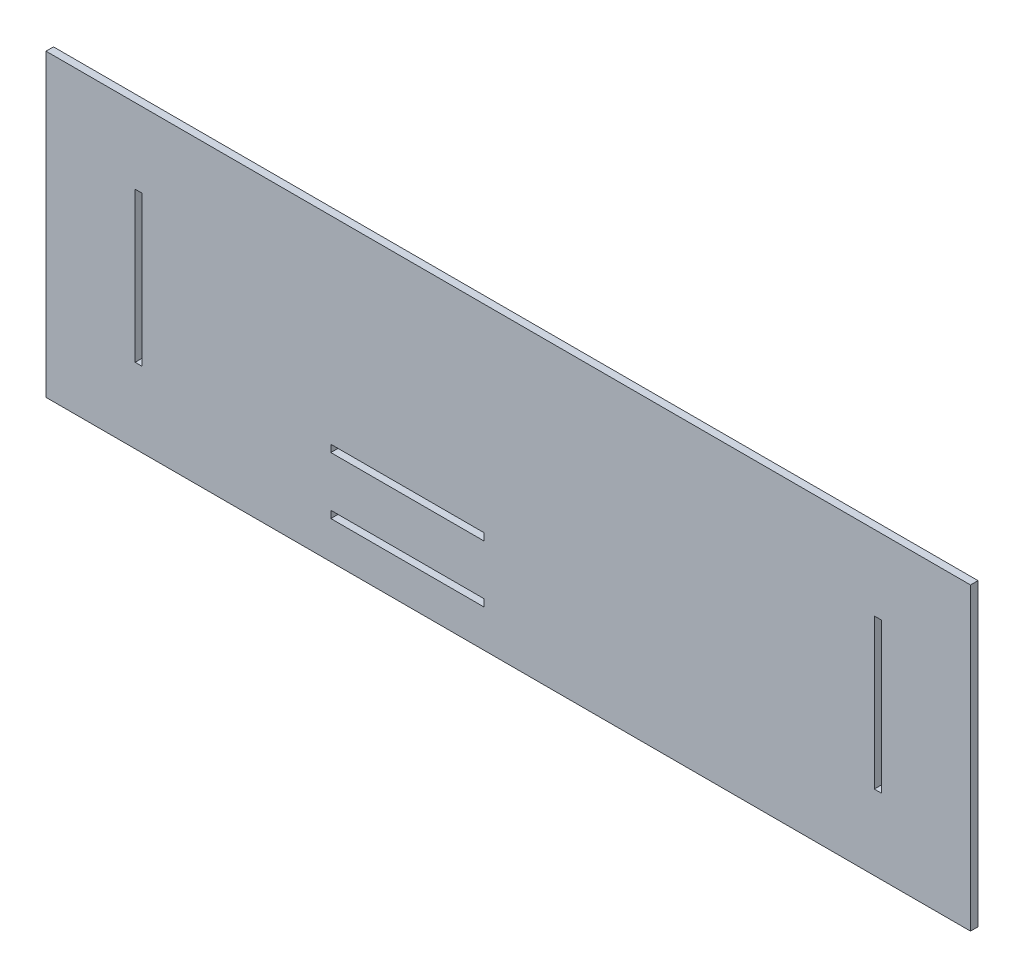
ISO-10303-21;
HEADER;
FILE_DESCRIPTION(('STEP AP214'),'2;1');
FILE_NAME('part.step','',(''),(''),'','','');
FILE_SCHEMA(('AUTOMOTIVE_DESIGN { 1 0 10303 214 1 1 1 1 }'));
ENDSEC;
DATA;
#1=APPLICATION_CONTEXT('core data for automotive mechanical design processes');
#2=APPLICATION_PROTOCOL_DEFINITION('international standard','automotive_design',2000,#1);
#3=PRODUCT_CONTEXT('',#1,'mechanical');
#4=PRODUCT('Part','Part','',(#3));
#5=PRODUCT_RELATED_PRODUCT_CATEGORY('part','',(#4));
#6=PRODUCT_DEFINITION_FORMATION('','',#4);
#7=PRODUCT_DEFINITION_CONTEXT('part definition',#1,'design');
#8=PRODUCT_DEFINITION('design','',#6,#7);
#9=PRODUCT_DEFINITION_SHAPE('','',#8);
#10=(LENGTH_UNIT() NAMED_UNIT(*) SI_UNIT(.MILLI.,.METRE.));
#11=(NAMED_UNIT(*) PLANE_ANGLE_UNIT() SI_UNIT($,.RADIAN.));
#12=(NAMED_UNIT(*) SI_UNIT($,.STERADIAN.) SOLID_ANGLE_UNIT());
#13=UNCERTAINTY_MEASURE_WITH_UNIT(LENGTH_MEASURE(1.E-05),#10,'distance_accuracy_value','');
#14=(GEOMETRIC_REPRESENTATION_CONTEXT(3) GLOBAL_UNCERTAINTY_ASSIGNED_CONTEXT((#13)) GLOBAL_UNIT_ASSIGNED_CONTEXT((#10,
#11,#12)) REPRESENTATION_CONTEXT('',''));
#15=CARTESIAN_POINT('',(0.,0.,0.));
#16=DIRECTION('',(0.,0.,1.));
#17=DIRECTION('',(1.,0.,0.));
#18=AXIS2_PLACEMENT_3D('',#15,#16,#17);
#19=CARTESIAN_POINT('',(0.,0.,3.));
#20=DIRECTION('',(0.,0.,1.));
#21=DIRECTION('',(1.,0.,0.));
#22=AXIS2_PLACEMENT_3D('',#19,#20,#21);
#23=PLANE('',#22);
#24=DIRECTION('',(0.,1.,0.));
#25=VECTOR('',#24,1.);
#26=CARTESIAN_POINT('',(185.,60.,3.));
#27=LINE('',#26,#25);
#28=CARTESIAN_POINT('',(185.,-60.,3.));
#29=VERTEX_POINT('',#28);
#30=CARTESIAN_POINT('',(185.,60.,3.));
#31=VERTEX_POINT('',#30);
#32=EDGE_CURVE('E357',#29,#31,#27,.T.);
#33=ORIENTED_EDGE('',*,*,#32,.T.);
#34=DIRECTION('',(-1.,0.,0.));
#35=VECTOR('',#34,1.);
#36=CARTESIAN_POINT('',(-185.,60.,3.));
#37=LINE('',#36,#35);
#38=CARTESIAN_POINT('',(-185.,60.,3.));
#39=VERTEX_POINT('',#38);
#40=EDGE_CURVE('E361',#31,#39,#37,.T.);
#41=ORIENTED_EDGE('',*,*,#40,.T.);
#42=DIRECTION('',(0.,-1.,0.));
#43=VECTOR('',#42,1.);
#44=CARTESIAN_POINT('',(-185.,60.,3.));
#45=LINE('',#44,#43);
#46=CARTESIAN_POINT('',(-185.,-60.,3.));
#47=VERTEX_POINT('',#46);
#48=EDGE_CURVE('E365',#39,#47,#45,.T.);
#49=ORIENTED_EDGE('',*,*,#48,.T.);
#50=DIRECTION('',(1.,0.,0.));
#51=VECTOR('',#50,1.);
#52=CARTESIAN_POINT('',(-185.,-60.,3.));
#53=LINE('',#52,#51);
#54=EDGE_CURVE('E368',#47,#29,#53,.T.);
#55=ORIENTED_EDGE('',*,*,#54,.T.);
#56=EDGE_LOOP('',(#33,#41,#49,#55));
#57=FACE_BOUND('',#56,.T.);
#58=DIRECTION('',(1.,0.,0.));
#59=VECTOR('',#58,1.);
#60=CARTESIAN_POINT('',(-149.34,-30.,3.));
#61=LINE('',#60,#59);
#62=CARTESIAN_POINT('',(-149.34,-30.,3.));
#63=VERTEX_POINT('',#62);
#64=CARTESIAN_POINT('',(-146.5,-30.,3.));
#65=VERTEX_POINT('',#64);
#66=EDGE_CURVE('E317',#63,#65,#61,.T.);
#67=ORIENTED_EDGE('',*,*,#66,.F.);
#68=DIRECTION('',(0.,-1.,0.));
#69=VECTOR('',#68,1.);
#70=CARTESIAN_POINT('',(-149.34,30.,3.));
#71=LINE('',#70,#69);
#72=CARTESIAN_POINT('',(-149.34,30.,3.));
#73=VERTEX_POINT('',#72);
#74=EDGE_CURVE('E314',#73,#63,#71,.T.);
#75=ORIENTED_EDGE('',*,*,#74,.F.);
#76=DIRECTION('',(-1.,0.,0.));
#77=VECTOR('',#76,1.);
#78=CARTESIAN_POINT('',(-149.34,30.,3.));
#79=LINE('',#78,#77);
#80=CARTESIAN_POINT('',(-146.5,30.,3.));
#81=VERTEX_POINT('',#80);
#82=EDGE_CURVE('E325',#81,#73,#79,.T.);
#83=ORIENTED_EDGE('',*,*,#82,.F.);
#84=DIRECTION('',(0.,1.,0.));
#85=VECTOR('',#84,1.);
#86=CARTESIAN_POINT('',(-146.5,30.,3.));
#87=LINE('',#86,#85);
#88=EDGE_CURVE('E321',#65,#81,#87,.T.);
#89=ORIENTED_EDGE('',*,*,#88,.F.);
#90=EDGE_LOOP('',(#67,#75,#83,#89));
#91=FACE_BOUND('',#90,.T.);
#92=DIRECTION('',(-1.,0.,0.));
#93=VECTOR('',#92,1.);
#94=CARTESIAN_POINT('',(149.34,30.,3.));
#95=LINE('',#94,#93);
#96=CARTESIAN_POINT('',(149.34,30.,3.));
#97=VERTEX_POINT('',#96);
#98=CARTESIAN_POINT('',(146.5,30.0000000000001,3.));
#99=VERTEX_POINT('',#98);
#100=EDGE_CURVE('E274',#97,#99,#95,.T.);
#101=ORIENTED_EDGE('',*,*,#100,.F.);
#102=DIRECTION('',(0.,1.,0.));
#103=VECTOR('',#102,1.);
#104=CARTESIAN_POINT('',(149.34,30.,3.));
#105=LINE('',#104,#103);
#106=CARTESIAN_POINT('',(149.34,-30.,3.));
#107=VERTEX_POINT('',#106);
#108=EDGE_CURVE('E271',#107,#97,#105,.T.);
#109=ORIENTED_EDGE('',*,*,#108,.F.);
#110=DIRECTION('',(1.,0.,0.));
#111=VECTOR('',#110,1.);
#112=CARTESIAN_POINT('',(149.34,-30.,3.));
#113=LINE('',#112,#111);
#114=CARTESIAN_POINT('',(146.5,-29.9999999999999,3.));
#115=VERTEX_POINT('',#114);
#116=EDGE_CURVE('E282',#115,#107,#113,.T.);
#117=ORIENTED_EDGE('',*,*,#116,.F.);
#118=DIRECTION('',(0.,-1.,0.));
#119=VECTOR('',#118,1.);
#120=CARTESIAN_POINT('',(146.5,30.0000000000001,3.));
#121=LINE('',#120,#119);
#122=EDGE_CURVE('E278',#99,#115,#121,.T.);
#123=ORIENTED_EDGE('',*,*,#122,.F.);
#124=EDGE_LOOP('',(#101,#109,#117,#123));
#125=FACE_BOUND('',#124,.T.);
#126=DIRECTION('',(1.,0.,0.));
#127=VECTOR('',#126,1.);
#128=CARTESIAN_POINT('',(-70.9999999999999,-45.,3.));
#129=LINE('',#128,#127);
#130=CARTESIAN_POINT('',(-70.9999999999999,-45.,3.));
#131=VERTEX_POINT('',#130);
#132=CARTESIAN_POINT('',(-9.74999999999992,-45.,3.));
#133=VERTEX_POINT('',#132);
#134=EDGE_CURVE('E231',#131,#133,#129,.T.);
#135=ORIENTED_EDGE('',*,*,#134,.F.);
#136=DIRECTION('',(0.,-1.,0.));
#137=VECTOR('',#136,1.);
#138=CARTESIAN_POINT('',(-70.9999999999999,-42.12,3.));
#139=LINE('',#138,#137);
#140=CARTESIAN_POINT('',(-70.9999999999999,-42.12,3.));
#141=VERTEX_POINT('',#140);
#142=EDGE_CURVE('E228',#141,#131,#139,.T.);
#143=ORIENTED_EDGE('',*,*,#142,.F.);
#144=DIRECTION('',(-1.,0.,0.));
#145=VECTOR('',#144,1.);
#146=CARTESIAN_POINT('',(-70.9999999999999,-42.12,3.));
#147=LINE('',#146,#145);
#148=CARTESIAN_POINT('',(-9.74999999999996,-42.1199999999999,3.));
#149=VERTEX_POINT('',#148);
#150=EDGE_CURVE('E239',#149,#141,#147,.T.);
#151=ORIENTED_EDGE('',*,*,#150,.F.);
#152=DIRECTION('',(0.,1.,0.));
#153=VECTOR('',#152,1.);
#154=CARTESIAN_POINT('',(-9.74999999999996,-42.1199999999999,3.));
#155=LINE('',#154,#153);
#156=EDGE_CURVE('E235',#133,#149,#155,.T.);
#157=ORIENTED_EDGE('',*,*,#156,.F.);
#158=EDGE_LOOP('',(#135,#143,#151,#157));
#159=FACE_BOUND('',#158,.T.);
#160=DIRECTION('',(1.,0.,0.));
#161=VECTOR('',#160,1.);
#162=CARTESIAN_POINT('',(-70.9999999999999,-22.12,3.));
#163=LINE('',#162,#161);
#164=CARTESIAN_POINT('',(-70.9999999999999,-22.12,3.));
#165=VERTEX_POINT('',#164);
#166=CARTESIAN_POINT('',(-9.74999999999996,-22.12,3.));
#167=VERTEX_POINT('',#166);
#168=EDGE_CURVE('E188',#165,#167,#163,.T.);
#169=ORIENTED_EDGE('',*,*,#168,.F.);
#170=DIRECTION('',(0.,-1.,0.));
#171=VECTOR('',#170,1.);
#172=CARTESIAN_POINT('',(-70.9999999999999,-19.24,3.));
#173=LINE('',#172,#171);
#174=CARTESIAN_POINT('',(-70.9999999999999,-19.24,3.));
#175=VERTEX_POINT('',#174);
#176=EDGE_CURVE('E179',#175,#165,#173,.T.);
#177=ORIENTED_EDGE('',*,*,#176,.F.);
#178=DIRECTION('',(-1.,0.,0.));
#179=VECTOR('',#178,1.);
#180=CARTESIAN_POINT('',(-70.9999999999999,-19.24,3.));
#181=LINE('',#180,#179);
#182=CARTESIAN_POINT('',(-9.74999999999996,-19.24,3.));
#183=VERTEX_POINT('',#182);
#184=EDGE_CURVE('E206',#183,#175,#181,.T.);
#185=ORIENTED_EDGE('',*,*,#184,.F.);
#186=DIRECTION('',(0.,1.,0.));
#187=VECTOR('',#186,1.);
#188=CARTESIAN_POINT('',(-9.74999999999996,-19.24,3.));
#189=LINE('',#188,#187);
#190=EDGE_CURVE('E201',#167,#183,#189,.T.);
#191=ORIENTED_EDGE('',*,*,#190,.F.);
#192=EDGE_LOOP('',(#169,#177,#185,#191));
#193=FACE_BOUND('',#192,.T.);
#194=ADVANCED_FACE('F41',(#57,#91,#125,#159,#193),#23,.T.);
#195=CARTESIAN_POINT('',(0.,0.,0.));
#196=DIRECTION('',(0.,0.,1.));
#197=DIRECTION('',(1.,0.,0.));
#198=AXIS2_PLACEMENT_3D('',#195,#196,#197);
#199=PLANE('',#198);
#200=DIRECTION('',(0.,-1.,0.));
#201=VECTOR('',#200,1.);
#202=CARTESIAN_POINT('',(-70.9999999999999,-42.12,0.));
#203=LINE('',#202,#201);
#204=CARTESIAN_POINT('',(-70.9999999999999,-42.12,0.));
#205=VERTEX_POINT('',#204);
#206=CARTESIAN_POINT('',(-70.9999999999999,-45.,0.));
#207=VERTEX_POINT('',#206);
#208=EDGE_CURVE('E197',#205,#207,#203,.T.);
#209=ORIENTED_EDGE('',*,*,#208,.T.);
#210=DIRECTION('',(1.,0.,0.));
#211=VECTOR('',#210,1.);
#212=CARTESIAN_POINT('',(-70.9999999999999,-45.,0.));
#213=LINE('',#212,#211);
#214=CARTESIAN_POINT('',(-9.74999999999992,-45.,0.));
#215=VERTEX_POINT('',#214);
#216=EDGE_CURVE('E246',#207,#215,#213,.T.);
#217=ORIENTED_EDGE('',*,*,#216,.T.);
#218=DIRECTION('',(0.,1.,0.));
#219=VECTOR('',#218,1.);
#220=CARTESIAN_POINT('',(-9.74999999999996,-42.1199999999999,0.));
#221=LINE('',#220,#219);
#222=CARTESIAN_POINT('',(-9.74999999999996,-42.1199999999999,0.));
#223=VERTEX_POINT('',#222);
#224=EDGE_CURVE('E250',#215,#223,#221,.T.);
#225=ORIENTED_EDGE('',*,*,#224,.T.);
#226=DIRECTION('',(-1.,0.,0.));
#227=VECTOR('',#226,1.);
#228=CARTESIAN_POINT('',(-70.9999999999999,-42.12,0.));
#229=LINE('',#228,#227);
#230=EDGE_CURVE('E232',#223,#205,#229,.T.);
#231=ORIENTED_EDGE('',*,*,#230,.T.);
#232=EDGE_LOOP('',(#209,#217,#225,#231));
#233=FACE_BOUND('',#232,.T.);
#234=DIRECTION('',(0.,-1.,0.));
#235=VECTOR('',#234,1.);
#236=CARTESIAN_POINT('',(-149.34,30.,0.));
#237=LINE('',#236,#235);
#238=CARTESIAN_POINT('',(-149.34,30.,0.));
#239=VERTEX_POINT('',#238);
#240=CARTESIAN_POINT('',(-149.34,-30.,0.));
#241=VERTEX_POINT('',#240);
#242=EDGE_CURVE('E313',#239,#241,#237,.T.);
#243=ORIENTED_EDGE('',*,*,#242,.T.);
#244=DIRECTION('',(1.,0.,0.));
#245=VECTOR('',#244,1.);
#246=CARTESIAN_POINT('',(-149.34,-30.,0.));
#247=LINE('',#246,#245);
#248=CARTESIAN_POINT('',(-146.5,-30.,0.));
#249=VERTEX_POINT('',#248);
#250=EDGE_CURVE('E332',#241,#249,#247,.T.);
#251=ORIENTED_EDGE('',*,*,#250,.T.);
#252=DIRECTION('',(0.,1.,0.));
#253=VECTOR('',#252,1.);
#254=CARTESIAN_POINT('',(-146.5,30.,0.));
#255=LINE('',#254,#253);
#256=CARTESIAN_POINT('',(-146.5,30.,0.));
#257=VERTEX_POINT('',#256);
#258=EDGE_CURVE('E336',#249,#257,#255,.T.);
#259=ORIENTED_EDGE('',*,*,#258,.T.);
#260=DIRECTION('',(-1.,0.,0.));
#261=VECTOR('',#260,1.);
#262=CARTESIAN_POINT('',(-149.34,30.,0.));
#263=LINE('',#262,#261);
#264=EDGE_CURVE('E318',#257,#239,#263,.T.);
#265=ORIENTED_EDGE('',*,*,#264,.T.);
#266=EDGE_LOOP('',(#243,#251,#259,#265));
#267=FACE_BOUND('',#266,.T.);
#268=DIRECTION('',(0.,1.,0.));
#269=VECTOR('',#268,1.);
#270=CARTESIAN_POINT('',(185.,60.,0.));
#271=LINE('',#270,#269);
#272=CARTESIAN_POINT('',(185.,-60.,0.));
#273=VERTEX_POINT('',#272);
#274=CARTESIAN_POINT('',(185.,60.,0.));
#275=VERTEX_POINT('',#274);
#276=EDGE_CURVE('E356',#273,#275,#271,.T.);
#277=ORIENTED_EDGE('',*,*,#276,.F.);
#278=DIRECTION('',(1.,0.,0.));
#279=VECTOR('',#278,1.);
#280=CARTESIAN_POINT('',(-185.,-60.,0.));
#281=LINE('',#280,#279);
#282=CARTESIAN_POINT('',(-185.,-60.,0.));
#283=VERTEX_POINT('',#282);
#284=EDGE_CURVE('E362',#283,#273,#281,.T.);
#285=ORIENTED_EDGE('',*,*,#284,.F.);
#286=DIRECTION('',(0.,-1.,0.));
#287=VECTOR('',#286,1.);
#288=CARTESIAN_POINT('',(-185.,60.,0.));
#289=LINE('',#288,#287);
#290=CARTESIAN_POINT('',(-185.,60.,0.));
#291=VERTEX_POINT('',#290);
#292=EDGE_CURVE('E378',#291,#283,#289,.T.);
#293=ORIENTED_EDGE('',*,*,#292,.F.);
#294=DIRECTION('',(-1.,0.,0.));
#295=VECTOR('',#294,1.);
#296=CARTESIAN_POINT('',(-185.,60.,0.));
#297=LINE('',#296,#295);
#298=EDGE_CURVE('E375',#275,#291,#297,.T.);
#299=ORIENTED_EDGE('',*,*,#298,.F.);
#300=EDGE_LOOP('',(#277,#285,#293,#299));
#301=FACE_BOUND('',#300,.T.);
#302=DIRECTION('',(0.,1.,0.));
#303=VECTOR('',#302,1.);
#304=CARTESIAN_POINT('',(149.34,30.,0.));
#305=LINE('',#304,#303);
#306=CARTESIAN_POINT('',(149.34,-30.,0.));
#307=VERTEX_POINT('',#306);
#308=CARTESIAN_POINT('',(149.34,30.,0.));
#309=VERTEX_POINT('',#308);
#310=EDGE_CURVE('E270',#307,#309,#305,.T.);
#311=ORIENTED_EDGE('',*,*,#310,.T.);
#312=DIRECTION('',(-1.,0.,0.));
#313=VECTOR('',#312,1.);
#314=CARTESIAN_POINT('',(149.34,30.,0.));
#315=LINE('',#314,#313);
#316=CARTESIAN_POINT('',(146.5,30.0000000000001,0.));
#317=VERTEX_POINT('',#316);
#318=EDGE_CURVE('E289',#309,#317,#315,.T.);
#319=ORIENTED_EDGE('',*,*,#318,.T.);
#320=DIRECTION('',(0.,-1.,0.));
#321=VECTOR('',#320,1.);
#322=CARTESIAN_POINT('',(146.5,30.0000000000001,0.));
#323=LINE('',#322,#321);
#324=CARTESIAN_POINT('',(146.5,-29.9999999999999,0.));
#325=VERTEX_POINT('',#324);
#326=EDGE_CURVE('E293',#317,#325,#323,.T.);
#327=ORIENTED_EDGE('',*,*,#326,.T.);
#328=DIRECTION('',(1.,0.,0.));
#329=VECTOR('',#328,1.);
#330=CARTESIAN_POINT('',(149.34,-30.,0.));
#331=LINE('',#330,#329);
#332=EDGE_CURVE('E275',#325,#307,#331,.T.);
#333=ORIENTED_EDGE('',*,*,#332,.T.);
#334=EDGE_LOOP('',(#311,#319,#327,#333));
#335=FACE_BOUND('',#334,.T.);
#336=DIRECTION('',(0.,-1.,0.));
#337=VECTOR('',#336,1.);
#338=CARTESIAN_POINT('',(-70.9999999999999,-19.24,0.));
#339=LINE('',#338,#337);
#340=CARTESIAN_POINT('',(-70.9999999999999,-19.24,0.));
#341=VERTEX_POINT('',#340);
#342=CARTESIAN_POINT('',(-70.9999999999999,-22.12,0.));
#343=VERTEX_POINT('',#342);
#344=EDGE_CURVE('E65',#341,#343,#339,.T.);
#345=ORIENTED_EDGE('',*,*,#344,.T.);
#346=DIRECTION('',(1.,0.,0.));
#347=VECTOR('',#346,1.);
#348=CARTESIAN_POINT('',(-70.9999999999999,-22.12,0.));
#349=LINE('',#348,#347);
#350=CARTESIAN_POINT('',(-9.74999999999996,-22.12,0.));
#351=VERTEX_POINT('',#350);
#352=EDGE_CURVE('E195',#343,#351,#349,.T.);
#353=ORIENTED_EDGE('',*,*,#352,.T.);
#354=DIRECTION('',(0.,1.,0.));
#355=VECTOR('',#354,1.);
#356=CARTESIAN_POINT('',(-9.74999999999996,-19.24,0.));
#357=LINE('',#356,#355);
#358=CARTESIAN_POINT('',(-9.74999999999996,-19.24,0.));
#359=VERTEX_POINT('',#358);
#360=EDGE_CURVE('E215',#351,#359,#357,.T.);
#361=ORIENTED_EDGE('',*,*,#360,.T.);
#362=DIRECTION('',(-1.,0.,0.));
#363=VECTOR('',#362,1.);
#364=CARTESIAN_POINT('',(-70.9999999999999,-19.24,0.));
#365=LINE('',#364,#363);
#366=EDGE_CURVE('E189',#359,#341,#365,.T.);
#367=ORIENTED_EDGE('',*,*,#366,.T.);
#368=EDGE_LOOP('',(#345,#353,#361,#367));
#369=FACE_BOUND('',#368,.T.);
#370=ADVANCED_FACE('F402',(#233,#267,#301,#335,#369),#199,.F.);
#371=CARTESIAN_POINT('',(185.,60.,3.));
#372=DIRECTION('',(-1.,0.,0.));
#373=DIRECTION('',(0.,-1.,0.));
#374=AXIS2_PLACEMENT_3D('',#371,#372,#373);
#375=PLANE('',#374);
#376=ORIENTED_EDGE('',*,*,#276,.T.);
#377=DIRECTION('',(0.,0.,-1.));
#378=VECTOR('',#377,1.);
#379=CARTESIAN_POINT('',(185.,60.,3.));
#380=LINE('',#379,#378);
#381=EDGE_CURVE('E11',#31,#275,#380,.T.);
#382=ORIENTED_EDGE('',*,*,#381,.F.);
#383=ORIENTED_EDGE('',*,*,#32,.F.);
#384=DIRECTION('',(0.,0.,-1.));
#385=VECTOR('',#384,1.);
#386=CARTESIAN_POINT('',(185.,-60.,3.));
#387=LINE('',#386,#385);
#388=EDGE_CURVE('E371',#29,#273,#387,.T.);
#389=ORIENTED_EDGE('',*,*,#388,.T.);
#390=EDGE_LOOP('',(#376,#382,#383,#389));
#391=FACE_BOUND('',#390,.T.);
#392=ADVANCED_FACE('F43',(#391),#375,.F.);
#393=CARTESIAN_POINT('',(-185.,60.,3.));
#394=DIRECTION('',(0.,-1.,0.));
#395=DIRECTION('',(0.,0.,-1.));
#396=AXIS2_PLACEMENT_3D('',#393,#394,#395);
#397=PLANE('',#396);
#398=ORIENTED_EDGE('',*,*,#298,.T.);
#399=DIRECTION('',(0.,0.,-1.));
#400=VECTOR('',#399,1.);
#401=CARTESIAN_POINT('',(-185.,60.,3.));
#402=LINE('',#401,#400);
#403=EDGE_CURVE('E50',#39,#291,#402,.T.);
#404=ORIENTED_EDGE('',*,*,#403,.F.);
#405=ORIENTED_EDGE('',*,*,#40,.F.);
#406=ORIENTED_EDGE('',*,*,#381,.T.);
#407=EDGE_LOOP('',(#398,#404,#405,#406));
#408=FACE_BOUND('',#407,.T.);
#409=ADVANCED_FACE('F413',(#408),#397,.F.);
#410=CARTESIAN_POINT('',(-185.,60.,3.));
#411=DIRECTION('',(1.,0.,0.));
#412=DIRECTION('',(0.,1.,0.));
#413=AXIS2_PLACEMENT_3D('',#410,#411,#412);
#414=PLANE('',#413);
#415=ORIENTED_EDGE('',*,*,#292,.T.);
#416=DIRECTION('',(0.,0.,-1.));
#417=VECTOR('',#416,1.);
#418=CARTESIAN_POINT('',(-185.,-60.,3.));
#419=LINE('',#418,#417);
#420=EDGE_CURVE('E386',#47,#283,#419,.T.);
#421=ORIENTED_EDGE('',*,*,#420,.F.);
#422=ORIENTED_EDGE('',*,*,#48,.F.);
#423=ORIENTED_EDGE('',*,*,#403,.T.);
#424=EDGE_LOOP('',(#415,#421,#422,#423));
#425=FACE_BOUND('',#424,.T.);
#426=ADVANCED_FACE('F396',(#425),#414,.F.);
#427=CARTESIAN_POINT('',(-185.,-60.,3.));
#428=DIRECTION('',(0.,1.,0.));
#429=DIRECTION('',(0.,0.,1.));
#430=AXIS2_PLACEMENT_3D('',#427,#428,#429);
#431=PLANE('',#430);
#432=ORIENTED_EDGE('',*,*,#284,.T.);
#433=ORIENTED_EDGE('',*,*,#388,.F.);
#434=ORIENTED_EDGE('',*,*,#54,.F.);
#435=ORIENTED_EDGE('',*,*,#420,.T.);
#436=EDGE_LOOP('',(#432,#433,#434,#435));
#437=FACE_BOUND('',#436,.T.);
#438=ADVANCED_FACE('F406',(#437),#431,.F.);
#439=CARTESIAN_POINT('',(-149.34,30.,3.));
#440=DIRECTION('',(1.,0.,0.));
#441=DIRECTION('',(0.,0.,-1.));
#442=AXIS2_PLACEMENT_3D('',#439,#440,#441);
#443=PLANE('',#442);
#444=ORIENTED_EDGE('',*,*,#242,.F.);
#445=DIRECTION('',(0.,0.,-1.));
#446=VECTOR('',#445,1.);
#447=CARTESIAN_POINT('',(-149.34,30.,3.));
#448=LINE('',#447,#446);
#449=EDGE_CURVE('E328',#73,#239,#448,.T.);
#450=ORIENTED_EDGE('',*,*,#449,.F.);
#451=ORIENTED_EDGE('',*,*,#74,.T.);
#452=DIRECTION('',(0.,0.,-1.));
#453=VECTOR('',#452,1.);
#454=CARTESIAN_POINT('',(-149.34,-30.,3.));
#455=LINE('',#454,#453);
#456=EDGE_CURVE('E352',#63,#241,#455,.T.);
#457=ORIENTED_EDGE('',*,*,#456,.T.);
#458=EDGE_LOOP('',(#444,#450,#451,#457));
#459=FACE_BOUND('',#458,.T.);
#460=ADVANCED_FACE('F428',(#459),#443,.T.);
#461=CARTESIAN_POINT('',(-149.34,-30.,3.));
#462=DIRECTION('',(0.,1.,0.));
#463=DIRECTION('',(0.,0.,1.));
#464=AXIS2_PLACEMENT_3D('',#461,#462,#463);
#465=PLANE('',#464);
#466=ORIENTED_EDGE('',*,*,#250,.F.);
#467=ORIENTED_EDGE('',*,*,#456,.F.);
#468=ORIENTED_EDGE('',*,*,#66,.T.);
#469=DIRECTION('',(0.,0.,-1.));
#470=VECTOR('',#469,1.);
#471=CARTESIAN_POINT('',(-146.5,-30.,3.));
#472=LINE('',#471,#470);
#473=EDGE_CURVE('E349',#65,#249,#472,.T.);
#474=ORIENTED_EDGE('',*,*,#473,.T.);
#475=EDGE_LOOP('',(#466,#467,#468,#474));
#476=FACE_BOUND('',#475,.T.);
#477=ADVANCED_FACE('F435',(#476),#465,.T.);
#478=CARTESIAN_POINT('',(-146.5,30.,3.));
#479=DIRECTION('',(-1.,0.,0.));
#480=DIRECTION('',(0.,0.,1.));
#481=AXIS2_PLACEMENT_3D('',#478,#479,#480);
#482=PLANE('',#481);
#483=ORIENTED_EDGE('',*,*,#258,.F.);
#484=ORIENTED_EDGE('',*,*,#473,.F.);
#485=ORIENTED_EDGE('',*,*,#88,.T.);
#486=DIRECTION('',(0.,0.,-1.));
#487=VECTOR('',#486,1.);
#488=CARTESIAN_POINT('',(-146.5,30.,3.));
#489=LINE('',#488,#487);
#490=EDGE_CURVE('E346',#81,#257,#489,.T.);
#491=ORIENTED_EDGE('',*,*,#490,.T.);
#492=EDGE_LOOP('',(#483,#484,#485,#491));
#493=FACE_BOUND('',#492,.T.);
#494=ADVANCED_FACE('F440',(#493),#482,.T.);
#495=CARTESIAN_POINT('',(-149.34,30.,3.));
#496=DIRECTION('',(0.,-1.,0.));
#497=DIRECTION('',(0.,0.,-1.));
#498=AXIS2_PLACEMENT_3D('',#495,#496,#497);
#499=PLANE('',#498);
#500=ORIENTED_EDGE('',*,*,#264,.F.);
#501=ORIENTED_EDGE('',*,*,#490,.F.);
#502=ORIENTED_EDGE('',*,*,#82,.T.);
#503=ORIENTED_EDGE('',*,*,#449,.T.);
#504=EDGE_LOOP('',(#500,#501,#502,#503));
#505=FACE_BOUND('',#504,.T.);
#506=ADVANCED_FACE('F448',(#505),#499,.T.);
#507=CARTESIAN_POINT('',(149.34,30.,3.));
#508=DIRECTION('',(-1.,0.,0.));
#509=DIRECTION('',(0.,0.,1.));
#510=AXIS2_PLACEMENT_3D('',#507,#508,#509);
#511=PLANE('',#510);
#512=ORIENTED_EDGE('',*,*,#310,.F.);
#513=DIRECTION('',(0.,0.,-1.));
#514=VECTOR('',#513,1.);
#515=CARTESIAN_POINT('',(149.34,-30.,3.));
#516=LINE('',#515,#514);
#517=EDGE_CURVE('E285',#107,#307,#516,.T.);
#518=ORIENTED_EDGE('',*,*,#517,.F.);
#519=ORIENTED_EDGE('',*,*,#108,.T.);
#520=DIRECTION('',(0.,0.,-1.));
#521=VECTOR('',#520,1.);
#522=CARTESIAN_POINT('',(149.34,30.,3.));
#523=LINE('',#522,#521);
#524=EDGE_CURVE('E309',#97,#309,#523,.T.);
#525=ORIENTED_EDGE('',*,*,#524,.T.);
#526=EDGE_LOOP('',(#512,#518,#519,#525));
#527=FACE_BOUND('',#526,.T.);
#528=ADVANCED_FACE('F502',(#527),#511,.T.);
#529=CARTESIAN_POINT('',(149.34,30.,3.));
#530=DIRECTION('',(0.,-1.,0.));
#531=DIRECTION('',(1.,0.,0.));
#532=AXIS2_PLACEMENT_3D('',#529,#530,#531);
#533=PLANE('',#532);
#534=ORIENTED_EDGE('',*,*,#318,.F.);
#535=ORIENTED_EDGE('',*,*,#524,.F.);
#536=ORIENTED_EDGE('',*,*,#100,.T.);
#537=DIRECTION('',(0.,0.,-1.));
#538=VECTOR('',#537,1.);
#539=CARTESIAN_POINT('',(146.5,30.0000000000001,3.));
#540=LINE('',#539,#538);
#541=EDGE_CURVE('E306',#99,#317,#540,.T.);
#542=ORIENTED_EDGE('',*,*,#541,.T.);
#543=EDGE_LOOP('',(#534,#535,#536,#542));
#544=FACE_BOUND('',#543,.T.);
#545=ADVANCED_FACE('F498',(#544),#533,.T.);
#546=CARTESIAN_POINT('',(146.5,30.0000000000001,3.));
#547=DIRECTION('',(1.,0.,0.));
#548=DIRECTION('',(0.,0.,-1.));
#549=AXIS2_PLACEMENT_3D('',#546,#547,#548);
#550=PLANE('',#549);
#551=ORIENTED_EDGE('',*,*,#326,.F.);
#552=ORIENTED_EDGE('',*,*,#541,.F.);
#553=ORIENTED_EDGE('',*,*,#122,.T.);
#554=DIRECTION('',(0.,0.,-1.));
#555=VECTOR('',#554,1.);
#556=CARTESIAN_POINT('',(146.5,-29.9999999999999,3.));
#557=LINE('',#556,#555);
#558=EDGE_CURVE('E303',#115,#325,#557,.T.);
#559=ORIENTED_EDGE('',*,*,#558,.T.);
#560=EDGE_LOOP('',(#551,#552,#553,#559));
#561=FACE_BOUND('',#560,.T.);
#562=ADVANCED_FACE('F494',(#561),#550,.T.);
#563=CARTESIAN_POINT('',(149.34,-30.,3.));
#564=DIRECTION('',(0.,1.,0.));
#565=DIRECTION('',(-1.,0.,0.));
#566=AXIS2_PLACEMENT_3D('',#563,#564,#565);
#567=PLANE('',#566);
#568=ORIENTED_EDGE('',*,*,#332,.F.);
#569=ORIENTED_EDGE('',*,*,#558,.F.);
#570=ORIENTED_EDGE('',*,*,#116,.T.);
#571=ORIENTED_EDGE('',*,*,#517,.T.);
#572=EDGE_LOOP('',(#568,#569,#570,#571));
#573=FACE_BOUND('',#572,.T.);
#574=ADVANCED_FACE('F491',(#573),#567,.T.);
#575=CARTESIAN_POINT('',(-70.9999999999999,-42.12,3.));
#576=DIRECTION('',(1.,0.,0.));
#577=DIRECTION('',(0.,0.,-1.));
#578=AXIS2_PLACEMENT_3D('',#575,#576,#577);
#579=PLANE('',#578);
#580=ORIENTED_EDGE('',*,*,#208,.F.);
#581=DIRECTION('',(0.,0.,-1.));
#582=VECTOR('',#581,1.);
#583=CARTESIAN_POINT('',(-70.9999999999999,-42.12,3.));
#584=LINE('',#583,#582);
#585=EDGE_CURVE('E242',#141,#205,#584,.T.);
#586=ORIENTED_EDGE('',*,*,#585,.F.);
#587=ORIENTED_EDGE('',*,*,#142,.T.);
#588=DIRECTION('',(0.,0.,-1.));
#589=VECTOR('',#588,1.);
#590=CARTESIAN_POINT('',(-70.9999999999999,-45.,3.));
#591=LINE('',#590,#589);
#592=EDGE_CURVE('E266',#131,#207,#591,.T.);
#593=ORIENTED_EDGE('',*,*,#592,.T.);
#594=EDGE_LOOP('',(#580,#586,#587,#593));
#595=FACE_BOUND('',#594,.T.);
#596=ADVANCED_FACE('F473',(#595),#579,.T.);
#597=CARTESIAN_POINT('',(-70.9999999999999,-45.,3.));
#598=DIRECTION('',(0.,1.,0.));
#599=DIRECTION('',(0.,0.,1.));
#600=AXIS2_PLACEMENT_3D('',#597,#598,#599);
#601=PLANE('',#600);
#602=ORIENTED_EDGE('',*,*,#216,.F.);
#603=ORIENTED_EDGE('',*,*,#592,.F.);
#604=ORIENTED_EDGE('',*,*,#134,.T.);
#605=DIRECTION('',(0.,0.,-1.));
#606=VECTOR('',#605,1.);
#607=CARTESIAN_POINT('',(-9.74999999999992,-45.,3.));
#608=LINE('',#607,#606);
#609=EDGE_CURVE('E263',#133,#215,#608,.T.);
#610=ORIENTED_EDGE('',*,*,#609,.T.);
#611=EDGE_LOOP('',(#602,#603,#604,#610));
#612=FACE_BOUND('',#611,.T.);
#613=ADVANCED_FACE('F467',(#612),#601,.T.);
#614=CARTESIAN_POINT('',(-9.74999999999996,-42.1199999999999,3.));
#615=DIRECTION('',(-1.,0.,0.));
#616=DIRECTION('',(0.,-1.,0.));
#617=AXIS2_PLACEMENT_3D('',#614,#615,#616);
#618=PLANE('',#617);
#619=ORIENTED_EDGE('',*,*,#224,.F.);
#620=ORIENTED_EDGE('',*,*,#609,.F.);
#621=ORIENTED_EDGE('',*,*,#156,.T.);
#622=DIRECTION('',(0.,0.,-1.));
#623=VECTOR('',#622,1.);
#624=CARTESIAN_POINT('',(-9.74999999999996,-42.1199999999999,3.));
#625=LINE('',#624,#623);
#626=EDGE_CURVE('E260',#149,#223,#625,.T.);
#627=ORIENTED_EDGE('',*,*,#626,.T.);
#628=EDGE_LOOP('',(#619,#620,#621,#627));
#629=FACE_BOUND('',#628,.T.);
#630=ADVANCED_FACE('F470',(#629),#618,.T.);
#631=CARTESIAN_POINT('',(-70.9999999999999,-42.12,3.));
#632=DIRECTION('',(0.,-1.,0.));
#633=DIRECTION('',(1.,0.,0.));
#634=AXIS2_PLACEMENT_3D('',#631,#632,#633);
#635=PLANE('',#634);
#636=ORIENTED_EDGE('',*,*,#230,.F.);
#637=ORIENTED_EDGE('',*,*,#626,.F.);
#638=ORIENTED_EDGE('',*,*,#150,.T.);
#639=ORIENTED_EDGE('',*,*,#585,.T.);
#640=EDGE_LOOP('',(#636,#637,#638,#639));
#641=FACE_BOUND('',#640,.T.);
#642=ADVANCED_FACE('F476',(#641),#635,.T.);
#643=CARTESIAN_POINT('',(-70.9999999999999,-19.24,3.));
#644=DIRECTION('',(1.,0.,0.));
#645=DIRECTION('',(0.,0.,-1.));
#646=AXIS2_PLACEMENT_3D('',#643,#644,#645);
#647=PLANE('',#646);
#648=ORIENTED_EDGE('',*,*,#344,.F.);
#649=DIRECTION('',(0.,0.,-1.));
#650=VECTOR('',#649,1.);
#651=CARTESIAN_POINT('',(-70.9999999999999,-19.24,3.));
#652=LINE('',#651,#650);
#653=EDGE_CURVE('E183',#175,#341,#652,.T.);
#654=ORIENTED_EDGE('',*,*,#653,.F.);
#655=ORIENTED_EDGE('',*,*,#176,.T.);
#656=DIRECTION('',(0.,0.,-1.));
#657=VECTOR('',#656,1.);
#658=CARTESIAN_POINT('',(-70.9999999999999,-22.12,3.));
#659=LINE('',#658,#657);
#660=EDGE_CURVE('E182',#165,#343,#659,.T.);
#661=ORIENTED_EDGE('',*,*,#660,.T.);
#662=EDGE_LOOP('',(#648,#654,#655,#661));
#663=FACE_BOUND('',#662,.T.);
#664=ADVANCED_FACE('F181',(#663),#647,.T.);
#665=CARTESIAN_POINT('',(-70.9999999999999,-22.12,3.));
#666=DIRECTION('',(0.,1.,0.));
#667=DIRECTION('',(0.,0.,1.));
#668=AXIS2_PLACEMENT_3D('',#665,#666,#667);
#669=PLANE('',#668);
#670=ORIENTED_EDGE('',*,*,#352,.F.);
#671=ORIENTED_EDGE('',*,*,#660,.F.);
#672=ORIENTED_EDGE('',*,*,#168,.T.);
#673=DIRECTION('',(0.,0.,-1.));
#674=VECTOR('',#673,1.);
#675=CARTESIAN_POINT('',(-9.74999999999996,-22.12,3.));
#676=LINE('',#675,#674);
#677=EDGE_CURVE('E198',#167,#351,#676,.T.);
#678=ORIENTED_EDGE('',*,*,#677,.T.);
#679=EDGE_LOOP('',(#670,#671,#672,#678));
#680=FACE_BOUND('',#679,.T.);
#681=ADVANCED_FACE('F192',(#680),#669,.T.);
#682=CARTESIAN_POINT('',(-9.74999999999996,-19.24,3.));
#683=DIRECTION('',(-1.,0.,0.));
#684=DIRECTION('',(0.,0.,1.));
#685=AXIS2_PLACEMENT_3D('',#682,#683,#684);
#686=PLANE('',#685);
#687=ORIENTED_EDGE('',*,*,#360,.F.);
#688=ORIENTED_EDGE('',*,*,#677,.F.);
#689=ORIENTED_EDGE('',*,*,#190,.T.);
#690=DIRECTION('',(0.,0.,-1.));
#691=VECTOR('',#690,1.);
#692=CARTESIAN_POINT('',(-9.74999999999996,-19.24,3.));
#693=LINE('',#692,#691);
#694=EDGE_CURVE('E57',#183,#359,#693,.T.);
#695=ORIENTED_EDGE('',*,*,#694,.T.);
#696=EDGE_LOOP('',(#687,#688,#689,#695));
#697=FACE_BOUND('',#696,.T.);
#698=ADVANCED_FACE('F565',(#697),#686,.T.);
#699=CARTESIAN_POINT('',(-70.9999999999999,-19.24,3.));
#700=DIRECTION('',(0.,-1.,0.));
#701=DIRECTION('',(0.,0.,-1.));
#702=AXIS2_PLACEMENT_3D('',#699,#700,#701);
#703=PLANE('',#702);
#704=ORIENTED_EDGE('',*,*,#366,.F.);
#705=ORIENTED_EDGE('',*,*,#694,.F.);
#706=ORIENTED_EDGE('',*,*,#184,.T.);
#707=ORIENTED_EDGE('',*,*,#653,.T.);
#708=EDGE_LOOP('',(#704,#705,#706,#707));
#709=FACE_BOUND('',#708,.T.);
#710=ADVANCED_FACE('F573',(#709),#703,.T.);
#711=CLOSED_SHELL('',(#194,#370,#392,#409,#426,#438,#460,#477,#494,#506,#528,#545,#562,#574,
#596,#613,#630,#642,#664,#681,#698,#710));
#712=MANIFOLD_SOLID_BREP('B2',#711);
#713=ADVANCED_BREP_SHAPE_REPRESENTATION('',(#18,#712),#14);
#714=SHAPE_DEFINITION_REPRESENTATION(#9,#713);
ENDSEC;
END-ISO-10303-21;
